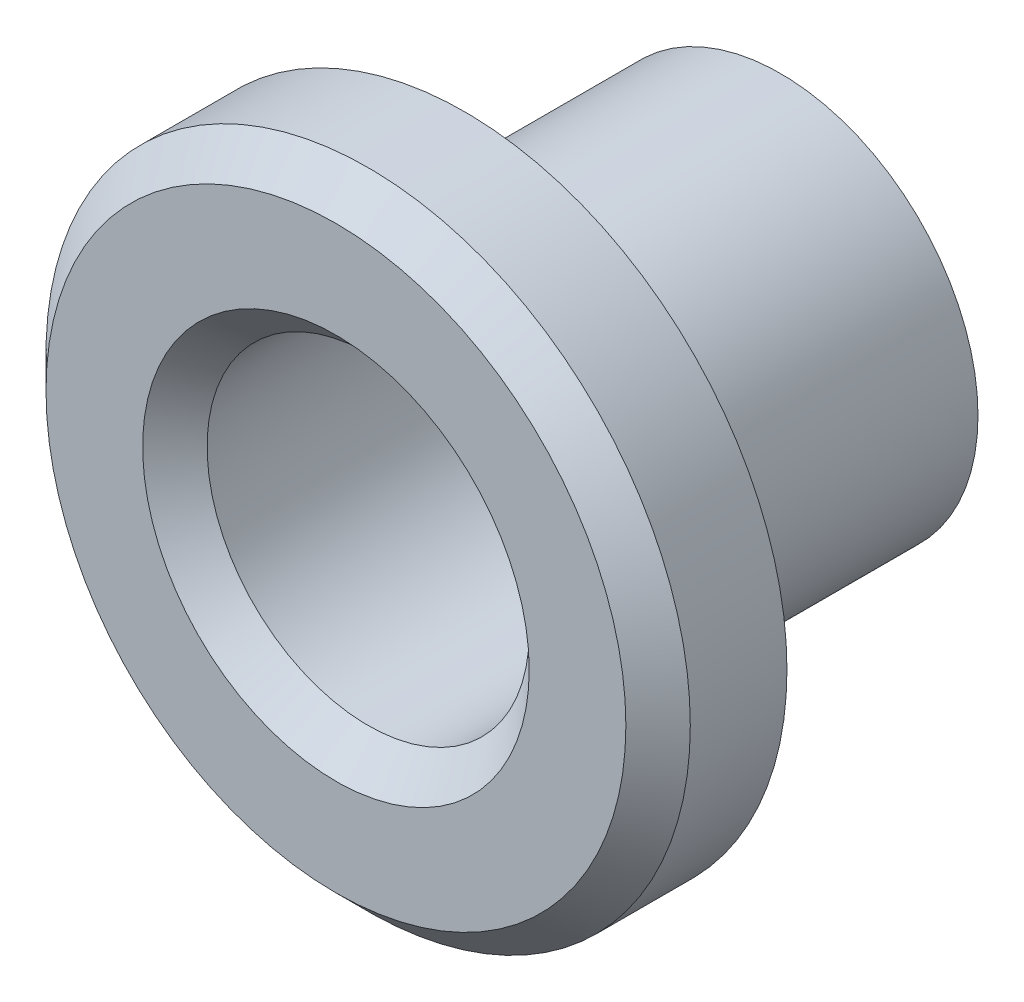
ISO-10303-21;
HEADER;
FILE_DESCRIPTION(('STEP AP214'),'2;1');
FILE_NAME('part.step','',(''),(''),'','','');
FILE_SCHEMA(('AUTOMOTIVE_DESIGN { 1 0 10303 214 1 1 1 1 }'));
ENDSEC;
DATA;
#1=APPLICATION_CONTEXT('core data for automotive mechanical design processes');
#2=APPLICATION_PROTOCOL_DEFINITION('international standard','automotive_design',2000,#1);
#3=PRODUCT_CONTEXT('',#1,'mechanical');
#4=PRODUCT('Part','Part','',(#3));
#5=PRODUCT_RELATED_PRODUCT_CATEGORY('part','',(#4));
#6=PRODUCT_DEFINITION_FORMATION('','',#4);
#7=PRODUCT_DEFINITION_CONTEXT('part definition',#1,'design');
#8=PRODUCT_DEFINITION('design','',#6,#7);
#9=PRODUCT_DEFINITION_SHAPE('','',#8);
#10=(LENGTH_UNIT() NAMED_UNIT(*) SI_UNIT(.MILLI.,.METRE.));
#11=(NAMED_UNIT(*) PLANE_ANGLE_UNIT() SI_UNIT($,.RADIAN.));
#12=(NAMED_UNIT(*) SI_UNIT($,.STERADIAN.) SOLID_ANGLE_UNIT());
#13=UNCERTAINTY_MEASURE_WITH_UNIT(LENGTH_MEASURE(1.E-05),#10,'distance_accuracy_value','');
#14=(GEOMETRIC_REPRESENTATION_CONTEXT(3) GLOBAL_UNCERTAINTY_ASSIGNED_CONTEXT((#13)) GLOBAL_UNIT_ASSIGNED_CONTEXT((#10,
#11,#12)) REPRESENTATION_CONTEXT('',''));
#15=CARTESIAN_POINT('',(0.,0.,0.));
#16=DIRECTION('',(0.,0.,1.));
#17=DIRECTION('',(1.,0.,0.));
#18=AXIS2_PLACEMENT_3D('',#15,#16,#17);
#19=CARTESIAN_POINT('',(0.,0.,4.9));
#20=DIRECTION('',(0.,0.,-1.));
#21=DIRECTION('',(-1.,0.,0.));
#22=AXIS2_PLACEMENT_3D('',#19,#20,#21);
#23=CYLINDRICAL_SURFACE('',#22,3.065);
#24=CARTESIAN_POINT('',(0.,0.,4.9));
#25=DIRECTION('',(0.,0.,1.));
#26=DIRECTION('',(1.,0.,0.));
#27=AXIS2_PLACEMENT_3D('',#24,#25,#26);
#28=CIRCLE('',#27,3.065);
#29=CARTESIAN_POINT('',(3.065,0.,4.9));
#30=VERTEX_POINT('',#29);
#31=EDGE_CURVE('E53',#30,#30,#28,.T.);
#32=ORIENTED_EDGE('',*,*,#31,.F.);
#33=EDGE_LOOP('',(#32));
#34=FACE_BOUND('',#33,.T.);
#35=CARTESIAN_POINT('',(0.,0.,0.));
#36=DIRECTION('',(0.,0.,1.));
#37=DIRECTION('',(1.,0.,0.));
#38=AXIS2_PLACEMENT_3D('',#35,#36,#37);
#39=CIRCLE('',#38,3.065);
#40=CARTESIAN_POINT('',(3.065,0.,0.));
#41=VERTEX_POINT('',#40);
#42=EDGE_CURVE('E54',#41,#41,#39,.T.);
#43=ORIENTED_EDGE('',*,*,#42,.T.);
#44=EDGE_LOOP('',(#43));
#45=FACE_BOUND('',#44,.T.);
#46=ADVANCED_FACE('F33',(#34,#45),#23,.T.);
#47=CARTESIAN_POINT('',(0.,0.,0.));
#48=DIRECTION('',(0.,0.,1.));
#49=DIRECTION('',(1.,0.,0.));
#50=AXIS2_PLACEMENT_3D('',#47,#48,#49);
#51=PLANE('',#50);
#52=CARTESIAN_POINT('',(0.,0.,0.));
#53=DIRECTION('',(0.,0.,1.));
#54=DIRECTION('',(1.,0.,0.));
#55=AXIS2_PLACEMENT_3D('',#52,#53,#54);
#56=CIRCLE('',#55,2.5);
#57=CARTESIAN_POINT('',(2.5,0.,0.));
#58=VERTEX_POINT('',#57);
#59=EDGE_CURVE('E62',#58,#58,#56,.T.);
#60=ORIENTED_EDGE('',*,*,#59,.T.);
#61=EDGE_LOOP('',(#60));
#62=FACE_BOUND('',#61,.T.);
#63=ORIENTED_EDGE('',*,*,#42,.F.);
#64=EDGE_LOOP('',(#63));
#65=FACE_BOUND('',#64,.T.);
#66=ADVANCED_FACE('F66',(#62,#65),#51,.F.);
#67=CARTESIAN_POINT('',(0.,0.,4.9));
#68=DIRECTION('',(0.,0.,1.));
#69=DIRECTION('',(1.,0.,0.));
#70=AXIS2_PLACEMENT_3D('',#67,#68,#69);
#71=PLANE('',#70);
#72=CARTESIAN_POINT('',(0.,0.,4.9));
#73=DIRECTION('',(0.,0.,1.));
#74=DIRECTION('',(1.,0.,0.));
#75=AXIS2_PLACEMENT_3D('',#72,#73,#74);
#76=CIRCLE('',#75,5.);
#77=CARTESIAN_POINT('',(5.,0.,4.9));
#78=VERTEX_POINT('',#77);
#79=EDGE_CURVE('E57',#78,#78,#76,.T.);
#80=ORIENTED_EDGE('',*,*,#79,.F.);
#81=EDGE_LOOP('',(#80));
#82=FACE_BOUND('',#81,.T.);
#83=ORIENTED_EDGE('',*,*,#31,.T.);
#84=EDGE_LOOP('',(#83));
#85=FACE_BOUND('',#84,.T.);
#86=ADVANCED_FACE('F87',(#82,#85),#71,.F.);
#87=CARTESIAN_POINT('',(0.,0.,6.9));
#88=DIRECTION('',(0.,0.,-1.));
#89=DIRECTION('',(-1.,0.,0.));
#90=AXIS2_PLACEMENT_3D('',#87,#88,#89);
#91=CYLINDRICAL_SURFACE('',#90,5.);
#92=CARTESIAN_POINT('',(0.,0.,6.4));
#93=DIRECTION('',(0.,0.,1.));
#94=DIRECTION('',(1.,0.,0.));
#95=AXIS2_PLACEMENT_3D('',#92,#93,#94);
#96=CIRCLE('',#95,5.);
#97=CARTESIAN_POINT('',(5.,0.,6.4));
#98=VERTEX_POINT('',#97);
#99=EDGE_CURVE('E44',#98,#98,#96,.F.);
#100=ORIENTED_EDGE('',*,*,#99,.T.);
#101=EDGE_LOOP('',(#100));
#102=FACE_BOUND('',#101,.T.);
#103=ORIENTED_EDGE('',*,*,#79,.T.);
#104=EDGE_LOOP('',(#103));
#105=FACE_BOUND('',#104,.T.);
#106=ADVANCED_FACE('F79',(#102,#105),#91,.T.);
#107=CARTESIAN_POINT('',(0.,0.,6.9));
#108=DIRECTION('',(0.,0.,1.));
#109=DIRECTION('',(1.,0.,0.));
#110=AXIS2_PLACEMENT_3D('',#107,#108,#109);
#111=PLANE('',#110);
#112=CARTESIAN_POINT('',(0.,0.,6.9));
#113=DIRECTION('',(0.,0.,1.));
#114=DIRECTION('',(1.,0.,0.));
#115=AXIS2_PLACEMENT_3D('',#112,#113,#114);
#116=CIRCLE('',#115,3.00000000000001);
#117=CARTESIAN_POINT('',(3.00000000000001,0.,6.9));
#118=VERTEX_POINT('',#117);
#119=EDGE_CURVE('E10',#118,#118,#116,.F.);
#120=ORIENTED_EDGE('',*,*,#119,.T.);
#121=EDGE_LOOP('',(#120));
#122=FACE_BOUND('',#121,.T.);
#123=CARTESIAN_POINT('',(0.,0.,6.9));
#124=DIRECTION('',(0.,0.,1.));
#125=DIRECTION('',(1.,0.,0.));
#126=AXIS2_PLACEMENT_3D('',#123,#124,#125);
#127=CIRCLE('',#126,4.5);
#128=CARTESIAN_POINT('',(4.5,0.,6.9));
#129=VERTEX_POINT('',#128);
#130=EDGE_CURVE('E48',#129,#129,#127,.T.);
#131=ORIENTED_EDGE('',*,*,#130,.T.);
#132=EDGE_LOOP('',(#131));
#133=FACE_BOUND('',#132,.T.);
#134=ADVANCED_FACE('F72',(#122,#133),#111,.T.);
#135=CARTESIAN_POINT('',(0.,0.,0.));
#136=DIRECTION('',(0.,0.,1.));
#137=DIRECTION('',(1.,0.,0.));
#138=AXIS2_PLACEMENT_3D('',#135,#136,#137);
#139=CYLINDRICAL_SURFACE('',#138,2.5);
#140=CARTESIAN_POINT('',(0.,0.,6.39999999999999));
#141=DIRECTION('',(0.,0.,1.));
#142=DIRECTION('',(1.,0.,0.));
#143=AXIS2_PLACEMENT_3D('',#140,#141,#142);
#144=CIRCLE('',#143,2.5);
#145=CARTESIAN_POINT('',(2.5,0.,6.39999999999999));
#146=VERTEX_POINT('',#145);
#147=EDGE_CURVE('E40',#146,#146,#144,.T.);
#148=ORIENTED_EDGE('',*,*,#147,.T.);
#149=EDGE_LOOP('',(#148));
#150=FACE_BOUND('',#149,.T.);
#151=ORIENTED_EDGE('',*,*,#59,.F.);
#152=EDGE_LOOP('',(#151));
#153=FACE_BOUND('',#152,.T.);
#154=ADVANCED_FACE('F69',(#150,#153),#139,.F.);
#155=CARTESIAN_POINT('',(0.,0.,6.9));
#156=DIRECTION('',(0.,0.,-1.));
#157=DIRECTION('',(-1.,0.,0.));
#158=AXIS2_PLACEMENT_3D('',#155,#156,#157);
#159=CONICAL_SURFACE('',#158,4.5,0.785398163397447);
#160=ORIENTED_EDGE('',*,*,#99,.F.);
#161=EDGE_LOOP('',(#160));
#162=FACE_BOUND('',#161,.T.);
#163=ORIENTED_EDGE('',*,*,#130,.F.);
#164=EDGE_LOOP('',(#163));
#165=FACE_BOUND('',#164,.T.);
#166=ADVANCED_FACE('F71',(#162,#165),#159,.T.);
#167=CARTESIAN_POINT('',(0.,0.,6.39999999999999));
#168=DIRECTION('',(0.,0.,1.));
#169=DIRECTION('',(1.,0.,0.));
#170=AXIS2_PLACEMENT_3D('',#167,#168,#169);
#171=CONICAL_SURFACE('',#170,2.5,0.78539816339745);
#172=ORIENTED_EDGE('',*,*,#119,.F.);
#173=EDGE_LOOP('',(#172));
#174=FACE_BOUND('',#173,.T.);
#175=ORIENTED_EDGE('',*,*,#147,.F.);
#176=EDGE_LOOP('',(#175));
#177=FACE_BOUND('',#176,.T.);
#178=ADVANCED_FACE('F35',(#174,#177),#171,.F.);
#179=CLOSED_SHELL('',(#46,#66,#86,#106,#134,#154,#166,#178));
#180=MANIFOLD_SOLID_BREP('B2',#179);
#181=ADVANCED_BREP_SHAPE_REPRESENTATION('',(#18,#180),#14);
#182=SHAPE_DEFINITION_REPRESENTATION(#9,#181);
ENDSEC;
END-ISO-10303-21;
